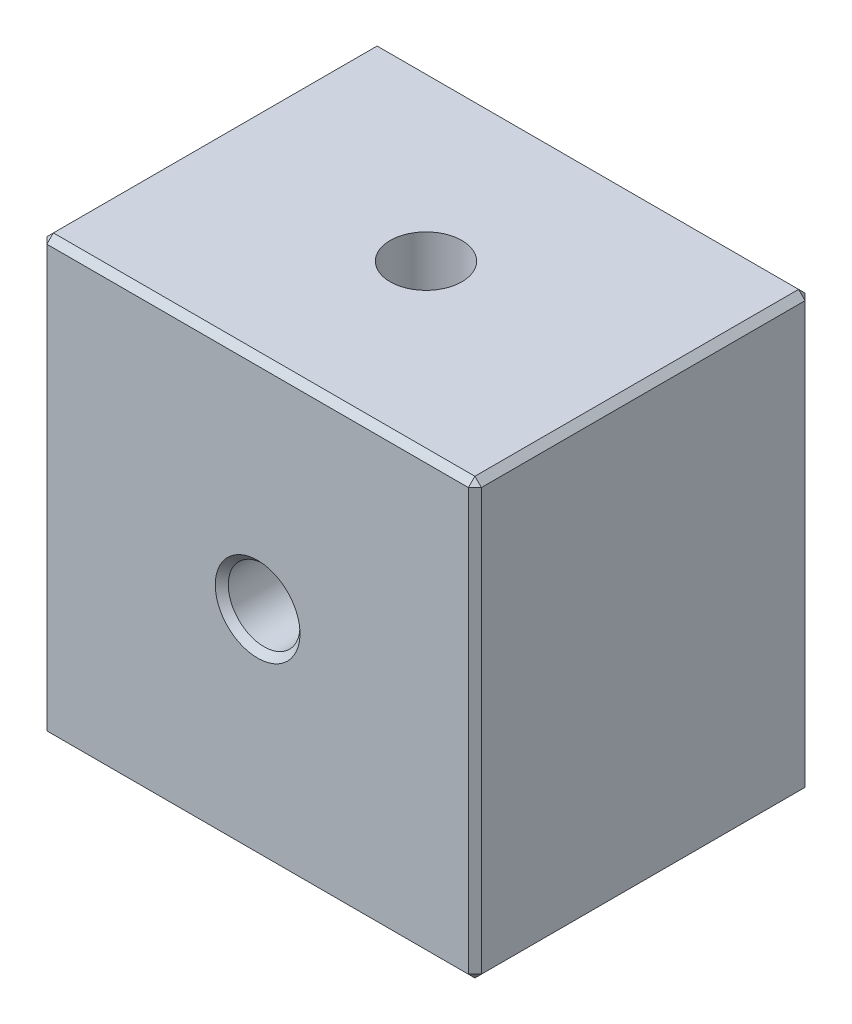
ISO-10303-21;
HEADER;
FILE_DESCRIPTION(('STEP AP214'),'2;1');
FILE_NAME('part.step','',(''),(''),'','','');
FILE_SCHEMA(('AUTOMOTIVE_DESIGN { 1 0 10303 214 1 1 1 1 }'));
ENDSEC;
DATA;
#1=APPLICATION_CONTEXT('core data for automotive mechanical design processes');
#2=APPLICATION_PROTOCOL_DEFINITION('international standard','automotive_design',2000,#1);
#3=PRODUCT_CONTEXT('',#1,'mechanical');
#4=PRODUCT('Part','Part','',(#3));
#5=PRODUCT_RELATED_PRODUCT_CATEGORY('part','',(#4));
#6=PRODUCT_DEFINITION_FORMATION('','',#4);
#7=PRODUCT_DEFINITION_CONTEXT('part definition',#1,'design');
#8=PRODUCT_DEFINITION('design','',#6,#7);
#9=PRODUCT_DEFINITION_SHAPE('','',#8);
#10=(LENGTH_UNIT() NAMED_UNIT(*) SI_UNIT(.MILLI.,.METRE.));
#11=(NAMED_UNIT(*) PLANE_ANGLE_UNIT() SI_UNIT($,.RADIAN.));
#12=(NAMED_UNIT(*) SI_UNIT($,.STERADIAN.) SOLID_ANGLE_UNIT());
#13=UNCERTAINTY_MEASURE_WITH_UNIT(LENGTH_MEASURE(1.E-05),#10,'distance_accuracy_value','');
#14=(GEOMETRIC_REPRESENTATION_CONTEXT(3) GLOBAL_UNCERTAINTY_ASSIGNED_CONTEXT((#13)) GLOBAL_UNIT_ASSIGNED_CONTEXT((#10,
#11,#12)) REPRESENTATION_CONTEXT('',''));
#15=CARTESIAN_POINT('',(0.,0.,0.));
#16=DIRECTION('',(0.,0.,1.));
#17=DIRECTION('',(1.,0.,0.));
#18=AXIS2_PLACEMENT_3D('',#15,#16,#17);
#19=CARTESIAN_POINT('',(0.,0.,7.75));
#20=DIRECTION('',(0.,0.,1.));
#21=DIRECTION('',(1.,0.,0.));
#22=AXIS2_PLACEMENT_3D('',#19,#20,#21);
#23=CYLINDRICAL_SURFACE('',#22,1.64999999999999);
#24=CARTESIAN_POINT('',(0.,0.,7.45000000000001));
#25=DIRECTION('',(0.,0.,-1.));
#26=DIRECTION('',(-1.,0.,0.));
#27=AXIS2_PLACEMENT_3D('',#24,#25,#26);
#28=CIRCLE('',#27,1.64999999999999);
#29=CARTESIAN_POINT('',(-1.64999999999999,0.,7.45000000000001));
#30=VERTEX_POINT('',#29);
#31=EDGE_CURVE('E155',#30,#30,#28,.F.);
#32=ORIENTED_EDGE('',*,*,#31,.T.);
#33=EDGE_LOOP('',(#32));
#34=FACE_BOUND('',#33,.T.);
#35=CARTESIAN_POINT('',(0.,0.,0.));
#36=DIRECTION('',(0.,-0.707106781186547,0.707106781186547));
#37=DIRECTION('',(0.,0.707106781186547,0.707106781186547));
#38=AXIS2_PLACEMENT_3D('',#35,#36,#37);
#39=ELLIPSE('',#38,2.3334523779156,1.64999999999999);
#40=CARTESIAN_POINT('',(-1.64999999999999,0.,0.));
#41=VERTEX_POINT('',#40);
#42=CARTESIAN_POINT('',(1.64999999999999,0.,0.));
#43=VERTEX_POINT('',#42);
#44=EDGE_CURVE('E147',#41,#43,#39,.F.);
#45=ORIENTED_EDGE('',*,*,#44,.T.);
#46=CARTESIAN_POINT('',(0.,0.,0.));
#47=DIRECTION('',(0.,0.707106781186547,0.707106781186547));
#48=DIRECTION('',(0.,-0.707106781186547,0.707106781186547));
#49=AXIS2_PLACEMENT_3D('',#46,#47,#48);
#50=ELLIPSE('',#49,2.3334523779156,1.64999999999999);
#51=EDGE_CURVE('E143',#43,#41,#50,.F.);
#52=ORIENTED_EDGE('',*,*,#51,.T.);
#53=EDGE_LOOP('',(#45,#52));
#54=FACE_BOUND('',#53,.T.);
#55=ADVANCED_FACE('F43',(#34,#54),#23,.F.);
#56=CARTESIAN_POINT('',(10.,-10.,7.75));
#57=DIRECTION('',(-1.,0.,0.));
#58=DIRECTION('',(0.,0.,1.));
#59=AXIS2_PLACEMENT_3D('',#56,#57,#58);
#60=PLANE('',#59);
#61=DIRECTION('',(0.,0.,-1.));
#62=VECTOR('',#61,1.);
#63=CARTESIAN_POINT('',(10.,-9.7,7.75));
#64=LINE('',#63,#62);
#65=CARTESIAN_POINT('',(10.,-9.7,7.44999999999999));
#66=VERTEX_POINT('',#65);
#67=CARTESIAN_POINT('',(10.,-9.7,-7.45));
#68=VERTEX_POINT('',#67);
#69=EDGE_CURVE('E206',#66,#68,#64,.T.);
#70=ORIENTED_EDGE('',*,*,#69,.T.);
#71=DIRECTION('',(0.,1.,0.));
#72=VECTOR('',#71,1.);
#73=CARTESIAN_POINT('',(10.,10.,-7.45));
#74=LINE('',#73,#72);
#75=CARTESIAN_POINT('',(10.,9.7,-7.45));
#76=VERTEX_POINT('',#75);
#77=EDGE_CURVE('E209',#68,#76,#74,.T.);
#78=ORIENTED_EDGE('',*,*,#77,.T.);
#79=DIRECTION('',(0.,0.,1.));
#80=VECTOR('',#79,1.);
#81=CARTESIAN_POINT('',(10.,9.7,7.75));
#82=LINE('',#81,#80);
#83=CARTESIAN_POINT('',(10.,9.7,7.44999999999999));
#84=VERTEX_POINT('',#83);
#85=EDGE_CURVE('E204',#76,#84,#82,.T.);
#86=ORIENTED_EDGE('',*,*,#85,.T.);
#87=DIRECTION('',(0.,-1.,0.));
#88=VECTOR('',#87,1.);
#89=CARTESIAN_POINT('',(10.,-10.,7.44999999999999));
#90=LINE('',#89,#88);
#91=EDGE_CURVE('E202',#84,#66,#90,.T.);
#92=ORIENTED_EDGE('',*,*,#91,.T.);
#93=EDGE_LOOP('',(#70,#78,#86,#92));
#94=FACE_BOUND('',#93,.T.);
#95=ADVANCED_FACE('F312',(#94),#60,.F.);
#96=CARTESIAN_POINT('',(-10.,10.,7.75));
#97=DIRECTION('',(0.,-1.,0.));
#98=DIRECTION('',(0.,0.,-1.));
#99=AXIS2_PLACEMENT_3D('',#96,#97,#98);
#100=PLANE('',#99);
#101=DIRECTION('',(-1.,0.,0.));
#102=VECTOR('',#101,1.);
#103=CARTESIAN_POINT('',(-10.,10.,-7.45));
#104=LINE('',#103,#102);
#105=CARTESIAN_POINT('',(9.7,10.,-7.45));
#106=VERTEX_POINT('',#105);
#107=CARTESIAN_POINT('',(-9.7,10.,-7.45));
#108=VERTEX_POINT('',#107);
#109=EDGE_CURVE('E188',#106,#108,#104,.T.);
#110=ORIENTED_EDGE('',*,*,#109,.T.);
#111=DIRECTION('',(0.,0.,1.));
#112=VECTOR('',#111,1.);
#113=CARTESIAN_POINT('',(-9.7,10.,7.75));
#114=LINE('',#113,#112);
#115=CARTESIAN_POINT('',(-9.7,10.,7.44999999999999));
#116=VERTEX_POINT('',#115);
#117=EDGE_CURVE('E190',#108,#116,#114,.T.);
#118=ORIENTED_EDGE('',*,*,#117,.T.);
#119=DIRECTION('',(1.,0.,0.));
#120=VECTOR('',#119,1.);
#121=CARTESIAN_POINT('',(-10.,10.,7.44999999999999));
#122=LINE('',#121,#120);
#123=CARTESIAN_POINT('',(9.7,10.,7.44999999999999));
#124=VERTEX_POINT('',#123);
#125=EDGE_CURVE('E184',#116,#124,#122,.T.);
#126=ORIENTED_EDGE('',*,*,#125,.T.);
#127=DIRECTION('',(0.,0.,-1.));
#128=VECTOR('',#127,1.);
#129=CARTESIAN_POINT('',(9.7,10.,7.75));
#130=LINE('',#129,#128);
#131=EDGE_CURVE('E186',#124,#106,#130,.T.);
#132=ORIENTED_EDGE('',*,*,#131,.T.);
#133=EDGE_LOOP('',(#110,#118,#126,#132));
#134=FACE_BOUND('',#133,.T.);
#135=CARTESIAN_POINT('',(0.,10.,0.));
#136=DIRECTION('',(0.,1.,0.));
#137=DIRECTION('',(0.,0.,1.));
#138=AXIS2_PLACEMENT_3D('',#135,#136,#137);
#139=CIRCLE('',#138,1.64999999999999);
#140=CARTESIAN_POINT('',(0.,10.,1.64999999999999));
#141=VERTEX_POINT('',#140);
#142=EDGE_CURVE('E284',#141,#141,#139,.T.);
#143=ORIENTED_EDGE('',*,*,#142,.F.);
#144=EDGE_LOOP('',(#143));
#145=FACE_BOUND('',#144,.T.);
#146=ADVANCED_FACE('F317',(#134,#145),#100,.F.);
#147=CARTESIAN_POINT('',(-10.,-10.,7.75));
#148=DIRECTION('',(1.,0.,0.));
#149=DIRECTION('',(0.,0.,-1.));
#150=AXIS2_PLACEMENT_3D('',#147,#148,#149);
#151=PLANE('',#150);
#152=DIRECTION('',(0.,1.,0.));
#153=VECTOR('',#152,1.);
#154=CARTESIAN_POINT('',(-10.,-10.,7.44999999999999));
#155=LINE('',#154,#153);
#156=CARTESIAN_POINT('',(-10.,-9.7,7.44999999999999));
#157=VERTEX_POINT('',#156);
#158=CARTESIAN_POINT('',(-10.,9.7,7.44999999999999));
#159=VERTEX_POINT('',#158);
#160=EDGE_CURVE('E179',#157,#159,#155,.T.);
#161=ORIENTED_EDGE('',*,*,#160,.T.);
#162=DIRECTION('',(0.,0.,-1.));
#163=VECTOR('',#162,1.);
#164=CARTESIAN_POINT('',(-10.,9.7,7.75));
#165=LINE('',#164,#163);
#166=CARTESIAN_POINT('',(-10.,9.7,-7.45));
#167=VERTEX_POINT('',#166);
#168=EDGE_CURVE('E181',#159,#167,#165,.T.);
#169=ORIENTED_EDGE('',*,*,#168,.T.);
#170=DIRECTION('',(0.,-1.,0.));
#171=VECTOR('',#170,1.);
#172=CARTESIAN_POINT('',(-10.,-10.,-7.45));
#173=LINE('',#172,#171);
#174=CARTESIAN_POINT('',(-10.,-9.7,-7.45));
#175=VERTEX_POINT('',#174);
#176=EDGE_CURVE('E177',#167,#175,#173,.T.);
#177=ORIENTED_EDGE('',*,*,#176,.T.);
#178=DIRECTION('',(0.,0.,1.));
#179=VECTOR('',#178,1.);
#180=CARTESIAN_POINT('',(-10.,-9.7,7.75));
#181=LINE('',#180,#179);
#182=EDGE_CURVE('E175',#175,#157,#181,.T.);
#183=ORIENTED_EDGE('',*,*,#182,.T.);
#184=EDGE_LOOP('',(#161,#169,#177,#183));
#185=FACE_BOUND('',#184,.T.);
#186=ADVANCED_FACE('F507',(#185),#151,.F.);
#187=CARTESIAN_POINT('',(-10.,-10.,7.75));
#188=DIRECTION('',(0.,1.,0.));
#189=DIRECTION('',(0.,0.,1.));
#190=AXIS2_PLACEMENT_3D('',#187,#188,#189);
#191=PLANE('',#190);
#192=DIRECTION('',(1.,0.,0.));
#193=VECTOR('',#192,1.);
#194=CARTESIAN_POINT('',(10.,-10.,-7.45));
#195=LINE('',#194,#193);
#196=CARTESIAN_POINT('',(-9.7,-10.,-7.45));
#197=VERTEX_POINT('',#196);
#198=CARTESIAN_POINT('',(9.7,-10.,-7.45));
#199=VERTEX_POINT('',#198);
#200=EDGE_CURVE('E211',#197,#199,#195,.T.);
#201=ORIENTED_EDGE('',*,*,#200,.T.);
#202=DIRECTION('',(0.,0.,1.));
#203=VECTOR('',#202,1.);
#204=CARTESIAN_POINT('',(9.7,-10.,7.75));
#205=LINE('',#204,#203);
#206=CARTESIAN_POINT('',(9.7,-10.,7.45));
#207=VERTEX_POINT('',#206);
#208=EDGE_CURVE('E11',#199,#207,#205,.T.);
#209=ORIENTED_EDGE('',*,*,#208,.T.);
#210=DIRECTION('',(-1.,0.,0.));
#211=VECTOR('',#210,1.);
#212=CARTESIAN_POINT('',(-10.,-10.,7.45));
#213=LINE('',#212,#211);
#214=CARTESIAN_POINT('',(-9.7,-10.,7.45));
#215=VERTEX_POINT('',#214);
#216=EDGE_CURVE('E53',#207,#215,#213,.T.);
#217=ORIENTED_EDGE('',*,*,#216,.T.);
#218=DIRECTION('',(0.,0.,-1.));
#219=VECTOR('',#218,1.);
#220=CARTESIAN_POINT('',(-9.7,-10.,7.75));
#221=LINE('',#220,#219);
#222=EDGE_CURVE('E213',#215,#197,#221,.T.);
#223=ORIENTED_EDGE('',*,*,#222,.T.);
#224=EDGE_LOOP('',(#201,#209,#217,#223));
#225=FACE_BOUND('',#224,.T.);
#226=CARTESIAN_POINT('',(0.,-10.,0.));
#227=DIRECTION('',(0.,1.,0.));
#228=DIRECTION('',(0.,0.,1.));
#229=AXIS2_PLACEMENT_3D('',#226,#227,#228);
#230=CIRCLE('',#229,1.65);
#231=CARTESIAN_POINT('',(0.,-10.,1.65));
#232=VERTEX_POINT('',#231);
#233=EDGE_CURVE('E289',#232,#232,#230,.T.);
#234=ORIENTED_EDGE('',*,*,#233,.T.);
#235=EDGE_LOOP('',(#234));
#236=FACE_BOUND('',#235,.T.);
#237=ADVANCED_FACE('F471',(#225,#236),#191,.F.);
#238=CARTESIAN_POINT('',(0.,0.,7.75));
#239=DIRECTION('',(0.,0.,-1.));
#240=DIRECTION('',(-1.,0.,0.));
#241=AXIS2_PLACEMENT_3D('',#238,#239,#240);
#242=PLANE('',#241);
#243=CARTESIAN_POINT('',(0.,0.,7.75));
#244=DIRECTION('',(0.,0.,-1.));
#245=DIRECTION('',(-1.,0.,0.));
#246=AXIS2_PLACEMENT_3D('',#243,#244,#245);
#247=CIRCLE('',#246,1.94999999999999);
#248=CARTESIAN_POINT('',(-1.94999999999999,0.,7.75));
#249=VERTEX_POINT('',#248);
#250=EDGE_CURVE('E172',#249,#249,#247,.T.);
#251=ORIENTED_EDGE('',*,*,#250,.T.);
#252=EDGE_LOOP('',(#251));
#253=FACE_BOUND('',#252,.T.);
#254=DIRECTION('',(0.,-1.,0.));
#255=VECTOR('',#254,1.);
#256=CARTESIAN_POINT('',(-9.7,0.,7.75));
#257=LINE('',#256,#255);
#258=CARTESIAN_POINT('',(-9.7,9.7,7.75));
#259=VERTEX_POINT('',#258);
#260=CARTESIAN_POINT('',(-9.7,-9.7,7.75));
#261=VERTEX_POINT('',#260);
#262=EDGE_CURVE('E163',#259,#261,#257,.T.);
#263=ORIENTED_EDGE('',*,*,#262,.T.);
#264=DIRECTION('',(1.,0.,0.));
#265=VECTOR('',#264,1.);
#266=CARTESIAN_POINT('',(0.,-9.7,7.75));
#267=LINE('',#266,#265);
#268=CARTESIAN_POINT('',(9.7,-9.7,7.75));
#269=VERTEX_POINT('',#268);
#270=EDGE_CURVE('E169',#261,#269,#267,.T.);
#271=ORIENTED_EDGE('',*,*,#270,.T.);
#272=DIRECTION('',(0.,1.,0.));
#273=VECTOR('',#272,1.);
#274=CARTESIAN_POINT('',(9.7,0.,7.75));
#275=LINE('',#274,#273);
#276=CARTESIAN_POINT('',(9.7,9.7,7.75));
#277=VERTEX_POINT('',#276);
#278=EDGE_CURVE('E167',#269,#277,#275,.T.);
#279=ORIENTED_EDGE('',*,*,#278,.T.);
#280=DIRECTION('',(-1.,0.,0.));
#281=VECTOR('',#280,1.);
#282=CARTESIAN_POINT('',(0.,9.7,7.75));
#283=LINE('',#282,#281);
#284=EDGE_CURVE('E165',#277,#259,#283,.T.);
#285=ORIENTED_EDGE('',*,*,#284,.T.);
#286=EDGE_LOOP('',(#263,#271,#279,#285));
#287=FACE_BOUND('',#286,.T.);
#288=ADVANCED_FACE('F307',(#253,#287),#242,.F.);
#289=CARTESIAN_POINT('',(0.,0.,-7.75));
#290=DIRECTION('',(0.,0.,-1.));
#291=DIRECTION('',(-1.,0.,0.));
#292=AXIS2_PLACEMENT_3D('',#289,#290,#291);
#293=PLANE('',#292);
#294=DIRECTION('',(0.,1.,0.));
#295=VECTOR('',#294,1.);
#296=CARTESIAN_POINT('',(-9.7,10.,-7.75));
#297=LINE('',#296,#295);
#298=CARTESIAN_POINT('',(-9.7,-9.7,-7.75));
#299=VERTEX_POINT('',#298);
#300=CARTESIAN_POINT('',(-9.7,9.7,-7.75));
#301=VERTEX_POINT('',#300);
#302=EDGE_CURVE('E195',#299,#301,#297,.T.);
#303=ORIENTED_EDGE('',*,*,#302,.T.);
#304=DIRECTION('',(1.,0.,0.));
#305=VECTOR('',#304,1.);
#306=CARTESIAN_POINT('',(10.,9.7,-7.75));
#307=LINE('',#306,#305);
#308=CARTESIAN_POINT('',(9.7,9.7,-7.75));
#309=VERTEX_POINT('',#308);
#310=EDGE_CURVE('E199',#301,#309,#307,.T.);
#311=ORIENTED_EDGE('',*,*,#310,.T.);
#312=DIRECTION('',(0.,-1.,0.));
#313=VECTOR('',#312,1.);
#314=CARTESIAN_POINT('',(9.7,-10.,-7.75));
#315=LINE('',#314,#313);
#316=CARTESIAN_POINT('',(9.7,-9.7,-7.75));
#317=VERTEX_POINT('',#316);
#318=EDGE_CURVE('E197',#309,#317,#315,.T.);
#319=ORIENTED_EDGE('',*,*,#318,.T.);
#320=DIRECTION('',(-1.,0.,0.));
#321=VECTOR('',#320,1.);
#322=CARTESIAN_POINT('',(-10.,-9.7,-7.75));
#323=LINE('',#322,#321);
#324=EDGE_CURVE('E193',#317,#299,#323,.T.);
#325=ORIENTED_EDGE('',*,*,#324,.T.);
#326=EDGE_LOOP('',(#303,#311,#319,#325));
#327=FACE_BOUND('',#326,.T.);
#328=CARTESIAN_POINT('',(0.,0.,-7.75));
#329=DIRECTION('',(0.,0.,1.));
#330=DIRECTION('',(1.,0.,0.));
#331=AXIS2_PLACEMENT_3D('',#328,#329,#330);
#332=CIRCLE('',#331,1.65);
#333=CARTESIAN_POINT('',(1.65,0.,-7.75));
#334=VERTEX_POINT('',#333);
#335=EDGE_CURVE('E153',#334,#334,#332,.T.);
#336=ORIENTED_EDGE('',*,*,#335,.T.);
#337=EDGE_LOOP('',(#336));
#338=FACE_BOUND('',#337,.T.);
#339=ADVANCED_FACE('F299',(#327,#338),#293,.T.);
#340=CARTESIAN_POINT('',(0.,0.,0.));
#341=DIRECTION('',(0.,-0.707106781186547,0.707106781186547));
#342=DIRECTION('',(0.,0.707106781186547,0.707106781186547));
#343=AXIS2_PLACEMENT_3D('',#340,#341,#342);
#344=ELLIPSE('',#343,2.3334523779156,1.64999999999999);
#345=EDGE_CURVE('E139',#41,#43,#344,.T.);
#346=ORIENTED_EDGE('',*,*,#345,.T.);
#347=CARTESIAN_POINT('',(0.,0.,0.));
#348=DIRECTION('',(0.,0.707106781186547,0.707106781186547));
#349=DIRECTION('',(0.,-0.707106781186547,0.707106781186547));
#350=AXIS2_PLACEMENT_3D('',#347,#348,#349);
#351=ELLIPSE('',#350,2.3334523779156,1.64999999999999);
#352=EDGE_CURVE('E146',#43,#41,#351,.T.);
#353=ORIENTED_EDGE('',*,*,#352,.T.);
#354=EDGE_LOOP('',(#346,#353));
#355=FACE_BOUND('',#354,.T.);
#356=ORIENTED_EDGE('',*,*,#335,.F.);
#357=EDGE_LOOP('',(#356));
#358=FACE_BOUND('',#357,.T.);
#359=ADVANCED_FACE('F157',(#355,#358),#23,.F.);
#360=CARTESIAN_POINT('',(0.,10.,0.));
#361=DIRECTION('',(0.,1.,0.));
#362=DIRECTION('',(0.,0.,1.));
#363=AXIS2_PLACEMENT_3D('',#360,#361,#362);
#364=CYLINDRICAL_SURFACE('',#363,1.64999999999999);
#365=ORIENTED_EDGE('',*,*,#142,.T.);
#366=EDGE_LOOP('',(#365));
#367=FACE_BOUND('',#366,.T.);
#368=ORIENTED_EDGE('',*,*,#44,.F.);
#369=ORIENTED_EDGE('',*,*,#352,.F.);
#370=EDGE_LOOP('',(#368,#369));
#371=FACE_BOUND('',#370,.T.);
#372=ADVANCED_FACE('F151',(#367,#371),#364,.F.);
#373=ORIENTED_EDGE('',*,*,#233,.F.);
#374=EDGE_LOOP('',(#373));
#375=FACE_BOUND('',#374,.T.);
#376=ORIENTED_EDGE('',*,*,#345,.F.);
#377=ORIENTED_EDGE('',*,*,#51,.F.);
#378=EDGE_LOOP('',(#376,#377));
#379=FACE_BOUND('',#378,.T.);
#380=ADVANCED_FACE('F141',(#375,#379),#364,.F.);
#381=CARTESIAN_POINT('',(0.,0.,7.45000000000001));
#382=DIRECTION('',(0.,0.,1.));
#383=DIRECTION('',(1.,0.,0.));
#384=AXIS2_PLACEMENT_3D('',#381,#382,#383);
#385=CONICAL_SURFACE('',#384,1.64999999999999,0.785398163397453);
#386=ORIENTED_EDGE('',*,*,#250,.F.);
#387=EDGE_LOOP('',(#386));
#388=FACE_BOUND('',#387,.T.);
#389=ORIENTED_EDGE('',*,*,#31,.F.);
#390=EDGE_LOOP('',(#389));
#391=FACE_BOUND('',#390,.T.);
#392=ADVANCED_FACE('F322',(#388,#391),#385,.F.);
#393=CARTESIAN_POINT('',(10.,-9.7,7.75));
#394=DIRECTION('',(-0.707106781186552,0.707106781186544,0.));
#395=DIRECTION('',(0.,0.,-1.));
#396=AXIS2_PLACEMENT_3D('',#393,#394,#395);
#397=PLANE('',#396);
#398=DIRECTION('',(-0.707106781186543,-0.707106781186551,0.));
#399=VECTOR('',#398,1.);
#400=CARTESIAN_POINT('',(9.7,-10.,7.45));
#401=LINE('',#400,#399);
#402=EDGE_CURVE('E48',#207,#66,#401,.F.);
#403=ORIENTED_EDGE('',*,*,#402,.F.);
#404=ORIENTED_EDGE('',*,*,#208,.F.);
#405=DIRECTION('',(0.707106781186543,0.707106781186551,0.));
#406=VECTOR('',#405,1.);
#407=CARTESIAN_POINT('',(10.,-9.7,-7.45));
#408=LINE('',#407,#406);
#409=EDGE_CURVE('E277',#68,#199,#408,.F.);
#410=ORIENTED_EDGE('',*,*,#409,.F.);
#411=ORIENTED_EDGE('',*,*,#69,.F.);
#412=EDGE_LOOP('',(#403,#404,#410,#411));
#413=FACE_BOUND('',#412,.T.);
#414=ADVANCED_FACE('F46',(#413),#397,.F.);
#415=CARTESIAN_POINT('',(9.7,-10.,7.45));
#416=DIRECTION('',(0.577350269189633,-0.577350269189619,0.577350269189626));
#417=DIRECTION('',(0.707106781186543,0.,-0.707106781186552));
#418=AXIS2_PLACEMENT_3D('',#415,#416,#417);
#419=PLANE('',#418);
#420=DIRECTION('',(0.,0.707106781186552,0.707106781186543));
#421=VECTOR('',#420,1.);
#422=CARTESIAN_POINT('',(9.7,-10.,7.45));
#423=LINE('',#422,#421);
#424=EDGE_CURVE('E273',#207,#269,#423,.T.);
#425=ORIENTED_EDGE('',*,*,#424,.F.);
#426=ORIENTED_EDGE('',*,*,#402,.T.);
#427=DIRECTION('',(0.707106781186543,0.,-0.707106781186552));
#428=VECTOR('',#427,1.);
#429=CARTESIAN_POINT('',(9.85,-9.7,7.6));
#430=LINE('',#429,#428);
#431=EDGE_CURVE('E275',#269,#66,#430,.T.);
#432=ORIENTED_EDGE('',*,*,#431,.F.);
#433=EDGE_LOOP('',(#425,#426,#432));
#434=FACE_BOUND('',#433,.T.);
#435=ADVANCED_FACE('F330',(#434),#419,.T.);
#436=CARTESIAN_POINT('',(10.,-9.7,-7.45));
#437=DIRECTION('',(0.577350269189626,-0.577350269189619,-0.577350269189632));
#438=DIRECTION('',(-0.707106781186552,0.,-0.707106781186543));
#439=AXIS2_PLACEMENT_3D('',#436,#437,#438);
#440=PLANE('',#439);
#441=DIRECTION('',(0.707106781186552,0.,0.707106781186543));
#442=VECTOR('',#441,1.);
#443=CARTESIAN_POINT('',(10.,-9.7,-7.45));
#444=LINE('',#443,#442);
#445=EDGE_CURVE('E267',#68,#317,#444,.F.);
#446=ORIENTED_EDGE('',*,*,#445,.F.);
#447=ORIENTED_EDGE('',*,*,#409,.T.);
#448=DIRECTION('',(0.,0.707106781186551,-0.707106781186543));
#449=VECTOR('',#448,1.);
#450=CARTESIAN_POINT('',(9.7,-9.85,-7.6));
#451=LINE('',#450,#449);
#452=EDGE_CURVE('E270',#317,#199,#451,.F.);
#453=ORIENTED_EDGE('',*,*,#452,.F.);
#454=EDGE_LOOP('',(#446,#447,#453));
#455=FACE_BOUND('',#454,.T.);
#456=ADVANCED_FACE('F457',(#455),#440,.T.);
#457=CARTESIAN_POINT('',(9.7,0.,7.75));
#458=DIRECTION('',(-0.707106781186552,0.,-0.707106781186544));
#459=DIRECTION('',(0.,1.,0.));
#460=AXIS2_PLACEMENT_3D('',#457,#458,#459);
#461=PLANE('',#460);
#462=ORIENTED_EDGE('',*,*,#431,.T.);
#463=ORIENTED_EDGE('',*,*,#91,.F.);
#464=DIRECTION('',(-0.707106781186543,0.,0.707106781186551));
#465=VECTOR('',#464,1.);
#466=CARTESIAN_POINT('',(10.,9.7,7.44999999999999));
#467=LINE('',#466,#465);
#468=EDGE_CURVE('E261',#277,#84,#467,.F.);
#469=ORIENTED_EDGE('',*,*,#468,.F.);
#470=ORIENTED_EDGE('',*,*,#278,.F.);
#471=EDGE_LOOP('',(#462,#463,#469,#470));
#472=FACE_BOUND('',#471,.T.);
#473=ADVANCED_FACE('F451',(#472),#461,.F.);
#474=CARTESIAN_POINT('',(0.,-9.7,7.75));
#475=DIRECTION('',(0.,0.707106781186544,-0.707106781186552));
#476=DIRECTION('',(1.,0.,0.));
#477=AXIS2_PLACEMENT_3D('',#474,#475,#476);
#478=PLANE('',#477);
#479=ORIENTED_EDGE('',*,*,#424,.T.);
#480=ORIENTED_EDGE('',*,*,#270,.F.);
#481=DIRECTION('',(0.,-0.707106781186552,-0.707106781186543));
#482=VECTOR('',#481,1.);
#483=CARTESIAN_POINT('',(-9.7,-10.,7.45));
#484=LINE('',#483,#482);
#485=EDGE_CURVE('E258',#215,#261,#484,.F.);
#486=ORIENTED_EDGE('',*,*,#485,.F.);
#487=ORIENTED_EDGE('',*,*,#216,.F.);
#488=EDGE_LOOP('',(#479,#480,#486,#487));
#489=FACE_BOUND('',#488,.T.);
#490=ADVANCED_FACE('F444',(#489),#478,.F.);
#491=CARTESIAN_POINT('',(-9.7,-10.,7.75));
#492=DIRECTION('',(0.707106781186552,0.707106781186544,0.));
#493=DIRECTION('',(0.,0.,-1.));
#494=AXIS2_PLACEMENT_3D('',#491,#492,#493);
#495=PLANE('',#494);
#496=DIRECTION('',(0.707106781186543,-0.707106781186551,0.));
#497=VECTOR('',#496,1.);
#498=CARTESIAN_POINT('',(-10.,-9.7,-7.45));
#499=LINE('',#498,#497);
#500=EDGE_CURVE('E252',#197,#175,#499,.F.);
#501=ORIENTED_EDGE('',*,*,#500,.F.);
#502=ORIENTED_EDGE('',*,*,#222,.F.);
#503=DIRECTION('',(-0.707106781186543,0.707106781186551,0.));
#504=VECTOR('',#503,1.);
#505=CARTESIAN_POINT('',(-9.7,-10.,7.45));
#506=LINE('',#505,#504);
#507=EDGE_CURVE('E255',#157,#215,#506,.F.);
#508=ORIENTED_EDGE('',*,*,#507,.F.);
#509=ORIENTED_EDGE('',*,*,#182,.F.);
#510=EDGE_LOOP('',(#501,#502,#508,#509));
#511=FACE_BOUND('',#510,.T.);
#512=ADVANCED_FACE('F437',(#511),#495,.F.);
#513=CARTESIAN_POINT('',(-10.,-10.,-7.45));
#514=DIRECTION('',(0.,-0.707106781186544,-0.707106781186552));
#515=DIRECTION('',(-1.,0.,0.));
#516=AXIS2_PLACEMENT_3D('',#513,#514,#515);
#517=PLANE('',#516);
#518=ORIENTED_EDGE('',*,*,#452,.T.);
#519=ORIENTED_EDGE('',*,*,#200,.F.);
#520=DIRECTION('',(0.,-0.707106781186551,0.707106781186543));
#521=VECTOR('',#520,1.);
#522=CARTESIAN_POINT('',(-9.7,-9.85,-7.6));
#523=LINE('',#522,#521);
#524=EDGE_CURVE('E249',#299,#197,#523,.T.);
#525=ORIENTED_EDGE('',*,*,#524,.F.);
#526=ORIENTED_EDGE('',*,*,#324,.F.);
#527=EDGE_LOOP('',(#518,#519,#525,#526));
#528=FACE_BOUND('',#527,.T.);
#529=ADVANCED_FACE('F430',(#528),#517,.T.);
#530=CARTESIAN_POINT('',(10.,-10.,-7.45));
#531=DIRECTION('',(0.707106781186544,0.,-0.707106781186552));
#532=DIRECTION('',(0.,-1.,0.));
#533=AXIS2_PLACEMENT_3D('',#530,#531,#532);
#534=PLANE('',#533);
#535=ORIENTED_EDGE('',*,*,#445,.T.);
#536=ORIENTED_EDGE('',*,*,#318,.F.);
#537=DIRECTION('',(-0.707106781186552,0.,-0.707106781186543));
#538=VECTOR('',#537,1.);
#539=CARTESIAN_POINT('',(9.7,9.7,-7.75));
#540=LINE('',#539,#538);
#541=EDGE_CURVE('E246',#76,#309,#540,.T.);
#542=ORIENTED_EDGE('',*,*,#541,.F.);
#543=ORIENTED_EDGE('',*,*,#77,.F.);
#544=EDGE_LOOP('',(#535,#536,#542,#543));
#545=FACE_BOUND('',#544,.T.);
#546=ADVANCED_FACE('F423',(#545),#534,.T.);
#547=CARTESIAN_POINT('',(9.7,10.,7.75));
#548=DIRECTION('',(-0.707106781186552,-0.707106781186544,0.));
#549=DIRECTION('',(0.,0.,-1.));
#550=AXIS2_PLACEMENT_3D('',#547,#548,#549);
#551=PLANE('',#550);
#552=DIRECTION('',(0.707106781186543,-0.707106781186552,0.));
#553=VECTOR('',#552,1.);
#554=CARTESIAN_POINT('',(10.,9.7,7.44999999999999));
#555=LINE('',#554,#553);
#556=EDGE_CURVE('E264',#84,#124,#555,.F.);
#557=ORIENTED_EDGE('',*,*,#556,.F.);
#558=ORIENTED_EDGE('',*,*,#85,.F.);
#559=DIRECTION('',(-0.707106781186543,0.707106781186551,0.));
#560=VECTOR('',#559,1.);
#561=CARTESIAN_POINT('',(9.85,9.85,-7.45));
#562=LINE('',#561,#560);
#563=EDGE_CURVE('E243',#106,#76,#562,.F.);
#564=ORIENTED_EDGE('',*,*,#563,.F.);
#565=ORIENTED_EDGE('',*,*,#131,.F.);
#566=EDGE_LOOP('',(#557,#558,#564,#565));
#567=FACE_BOUND('',#566,.T.);
#568=ADVANCED_FACE('F416',(#567),#551,.F.);
#569=CARTESIAN_POINT('',(10.,9.7,7.44999999999999));
#570=DIRECTION('',(0.577350269189632,0.577350269189626,0.577350269189619));
#571=DIRECTION('',(-0.707106781186543,0.707106781186552,0.));
#572=AXIS2_PLACEMENT_3D('',#569,#570,#571);
#573=PLANE('',#572);
#574=ORIENTED_EDGE('',*,*,#468,.T.);
#575=ORIENTED_EDGE('',*,*,#556,.T.);
#576=DIRECTION('',(0.,0.707106781186543,-0.707106781186551));
#577=VECTOR('',#576,1.);
#578=CARTESIAN_POINT('',(9.7,9.85,7.6));
#579=LINE('',#578,#577);
#580=EDGE_CURVE('E240',#277,#124,#579,.T.);
#581=ORIENTED_EDGE('',*,*,#580,.F.);
#582=EDGE_LOOP('',(#574,#575,#581));
#583=FACE_BOUND('',#582,.T.);
#584=ADVANCED_FACE('F409',(#583),#573,.T.);
#585=CARTESIAN_POINT('',(-9.7,-10.,7.45));
#586=DIRECTION('',(-0.577350269189633,-0.577350269189619,0.577350269189626));
#587=DIRECTION('',(0.707106781186543,0.,0.707106781186552));
#588=AXIS2_PLACEMENT_3D('',#585,#586,#587);
#589=PLANE('',#588);
#590=ORIENTED_EDGE('',*,*,#507,.T.);
#591=ORIENTED_EDGE('',*,*,#485,.T.);
#592=DIRECTION('',(0.707106781186543,0.,0.707106781186552));
#593=VECTOR('',#592,1.);
#594=CARTESIAN_POINT('',(-9.85,-9.7,7.6));
#595=LINE('',#594,#593);
#596=EDGE_CURVE('E237',#157,#261,#595,.T.);
#597=ORIENTED_EDGE('',*,*,#596,.F.);
#598=EDGE_LOOP('',(#590,#591,#597));
#599=FACE_BOUND('',#598,.T.);
#600=ADVANCED_FACE('F402',(#599),#589,.T.);
#601=CARTESIAN_POINT('',(-10.,-9.7,-7.45));
#602=DIRECTION('',(-0.577350269189626,-0.577350269189619,-0.577350269189632));
#603=DIRECTION('',(-0.707106781186552,0.,0.707106781186543));
#604=AXIS2_PLACEMENT_3D('',#601,#602,#603);
#605=PLANE('',#604);
#606=ORIENTED_EDGE('',*,*,#524,.T.);
#607=ORIENTED_EDGE('',*,*,#500,.T.);
#608=DIRECTION('',(0.707106781186552,0.,-0.707106781186543));
#609=VECTOR('',#608,1.);
#610=CARTESIAN_POINT('',(-10.,-9.7,-7.45));
#611=LINE('',#610,#609);
#612=EDGE_CURVE('E234',#299,#175,#611,.F.);
#613=ORIENTED_EDGE('',*,*,#612,.F.);
#614=EDGE_LOOP('',(#606,#607,#613));
#615=FACE_BOUND('',#614,.T.);
#616=ADVANCED_FACE('F395',(#615),#605,.T.);
#617=CARTESIAN_POINT('',(9.7,9.7,-7.75));
#618=DIRECTION('',(0.577350269189626,0.577350269189619,-0.577350269189632));
#619=DIRECTION('',(-0.707106781186552,0.,-0.707106781186543));
#620=AXIS2_PLACEMENT_3D('',#617,#618,#619);
#621=PLANE('',#620);
#622=ORIENTED_EDGE('',*,*,#563,.T.);
#623=ORIENTED_EDGE('',*,*,#541,.T.);
#624=DIRECTION('',(0.,0.707106781186551,0.707106781186543));
#625=VECTOR('',#624,1.);
#626=CARTESIAN_POINT('',(9.7,9.7,-7.75));
#627=LINE('',#626,#625);
#628=EDGE_CURVE('E232',#106,#309,#627,.F.);
#629=ORIENTED_EDGE('',*,*,#628,.F.);
#630=EDGE_LOOP('',(#622,#623,#629));
#631=FACE_BOUND('',#630,.T.);
#632=ADVANCED_FACE('F388',(#631),#621,.T.);
#633=CARTESIAN_POINT('',(0.,9.7,7.75));
#634=DIRECTION('',(0.,-0.707106781186552,-0.707106781186544));
#635=DIRECTION('',(-1.,0.,0.));
#636=AXIS2_PLACEMENT_3D('',#633,#634,#635);
#637=PLANE('',#636);
#638=ORIENTED_EDGE('',*,*,#580,.T.);
#639=ORIENTED_EDGE('',*,*,#125,.F.);
#640=DIRECTION('',(0.,-0.707106781186543,0.707106781186551));
#641=VECTOR('',#640,1.);
#642=CARTESIAN_POINT('',(-9.7,10.,7.44999999999999));
#643=LINE('',#642,#641);
#644=EDGE_CURVE('E229',#259,#116,#643,.F.);
#645=ORIENTED_EDGE('',*,*,#644,.F.);
#646=ORIENTED_EDGE('',*,*,#284,.F.);
#647=EDGE_LOOP('',(#638,#639,#645,#646));
#648=FACE_BOUND('',#647,.T.);
#649=ADVANCED_FACE('F381',(#648),#637,.F.);
#650=CARTESIAN_POINT('',(-9.7,0.,7.75));
#651=DIRECTION('',(0.707106781186552,0.,-0.707106781186544));
#652=DIRECTION('',(0.,-1.,0.));
#653=AXIS2_PLACEMENT_3D('',#650,#651,#652);
#654=PLANE('',#653);
#655=ORIENTED_EDGE('',*,*,#596,.T.);
#656=ORIENTED_EDGE('',*,*,#262,.F.);
#657=DIRECTION('',(-0.707106781186543,0.,-0.707106781186551));
#658=VECTOR('',#657,1.);
#659=CARTESIAN_POINT('',(-9.85,9.7,7.6));
#660=LINE('',#659,#658);
#661=EDGE_CURVE('E226',#159,#259,#660,.F.);
#662=ORIENTED_EDGE('',*,*,#661,.F.);
#663=ORIENTED_EDGE('',*,*,#160,.F.);
#664=EDGE_LOOP('',(#655,#656,#662,#663));
#665=FACE_BOUND('',#664,.T.);
#666=ADVANCED_FACE('F374',(#665),#654,.F.);
#667=CARTESIAN_POINT('',(-10.,-10.,-7.45));
#668=DIRECTION('',(-0.707106781186544,0.,-0.707106781186552));
#669=DIRECTION('',(0.,1.,0.));
#670=AXIS2_PLACEMENT_3D('',#667,#668,#669);
#671=PLANE('',#670);
#672=ORIENTED_EDGE('',*,*,#612,.T.);
#673=ORIENTED_EDGE('',*,*,#176,.F.);
#674=DIRECTION('',(-0.707106781186551,0.,0.707106781186543));
#675=VECTOR('',#674,1.);
#676=CARTESIAN_POINT('',(-10.,9.7,-7.45));
#677=LINE('',#676,#675);
#678=EDGE_CURVE('E223',#301,#167,#677,.T.);
#679=ORIENTED_EDGE('',*,*,#678,.F.);
#680=ORIENTED_EDGE('',*,*,#302,.F.);
#681=EDGE_LOOP('',(#672,#673,#679,#680));
#682=FACE_BOUND('',#681,.T.);
#683=ADVANCED_FACE('F367',(#682),#671,.T.);
#684=CARTESIAN_POINT('',(-10.,10.,-7.45));
#685=DIRECTION('',(0.,0.707106781186544,-0.707106781186552));
#686=DIRECTION('',(1.,0.,0.));
#687=AXIS2_PLACEMENT_3D('',#684,#685,#686);
#688=PLANE('',#687);
#689=ORIENTED_EDGE('',*,*,#628,.T.);
#690=ORIENTED_EDGE('',*,*,#310,.F.);
#691=DIRECTION('',(0.,-0.707106781186552,-0.707106781186543));
#692=VECTOR('',#691,1.);
#693=CARTESIAN_POINT('',(-9.7,9.85,-7.6));
#694=LINE('',#693,#692);
#695=EDGE_CURVE('E220',#108,#301,#694,.T.);
#696=ORIENTED_EDGE('',*,*,#695,.F.);
#697=ORIENTED_EDGE('',*,*,#109,.F.);
#698=EDGE_LOOP('',(#689,#690,#696,#697));
#699=FACE_BOUND('',#698,.T.);
#700=ADVANCED_FACE('F360',(#699),#688,.T.);
#701=CARTESIAN_POINT('',(-9.7,10.,7.44999999999999));
#702=DIRECTION('',(-0.577350269189626,0.577350269189632,0.577350269189619));
#703=DIRECTION('',(-0.707106781186552,-0.707106781186543,0.));
#704=AXIS2_PLACEMENT_3D('',#701,#702,#703);
#705=PLANE('',#704);
#706=ORIENTED_EDGE('',*,*,#661,.T.);
#707=ORIENTED_EDGE('',*,*,#644,.T.);
#708=DIRECTION('',(0.707106781186552,0.707106781186543,0.));
#709=VECTOR('',#708,1.);
#710=CARTESIAN_POINT('',(-9.7,10.,7.44999999999999));
#711=LINE('',#710,#709);
#712=EDGE_CURVE('E218',#159,#116,#711,.T.);
#713=ORIENTED_EDGE('',*,*,#712,.F.);
#714=EDGE_LOOP('',(#706,#707,#713));
#715=FACE_BOUND('',#714,.T.);
#716=ADVANCED_FACE('F353',(#715),#705,.T.);
#717=CARTESIAN_POINT('',(-10.,9.7,-7.45));
#718=DIRECTION('',(-0.577350269189619,0.577350269189626,-0.577350269189633));
#719=DIRECTION('',(0.,0.707106781186552,0.707106781186543));
#720=AXIS2_PLACEMENT_3D('',#717,#718,#719);
#721=PLANE('',#720);
#722=ORIENTED_EDGE('',*,*,#695,.T.);
#723=ORIENTED_EDGE('',*,*,#678,.T.);
#724=DIRECTION('',(-0.707106781186552,-0.707106781186543,0.));
#725=VECTOR('',#724,1.);
#726=CARTESIAN_POINT('',(-10.,9.7,-7.45));
#727=LINE('',#726,#725);
#728=EDGE_CURVE('E216',#108,#167,#727,.T.);
#729=ORIENTED_EDGE('',*,*,#728,.F.);
#730=EDGE_LOOP('',(#722,#723,#729));
#731=FACE_BOUND('',#730,.T.);
#732=ADVANCED_FACE('F346',(#731),#721,.T.);
#733=CARTESIAN_POINT('',(-10.,9.7,7.75));
#734=DIRECTION('',(0.707106781186544,-0.707106781186552,0.));
#735=DIRECTION('',(0.,0.,-1.));
#736=AXIS2_PLACEMENT_3D('',#733,#734,#735);
#737=PLANE('',#736);
#738=ORIENTED_EDGE('',*,*,#712,.T.);
#739=ORIENTED_EDGE('',*,*,#117,.F.);
#740=ORIENTED_EDGE('',*,*,#728,.T.);
#741=ORIENTED_EDGE('',*,*,#168,.F.);
#742=EDGE_LOOP('',(#738,#739,#740,#741));
#743=FACE_BOUND('',#742,.T.);
#744=ADVANCED_FACE('F340',(#743),#737,.F.);
#745=CLOSED_SHELL('',(#55,#95,#146,#186,#237,#288,#339,#359,#372,#380,#392,#414,#435,#456,#473,
#490,#512,#529,#546,#568,#584,#600,#616,#632,#649,#666,#683,#700,#716,#732,#744));
#746=MANIFOLD_SOLID_BREP('B2',#745);
#747=ADVANCED_BREP_SHAPE_REPRESENTATION('',(#18,#746),#14);
#748=SHAPE_DEFINITION_REPRESENTATION(#9,#747);
ENDSEC;
END-ISO-10303-21;
